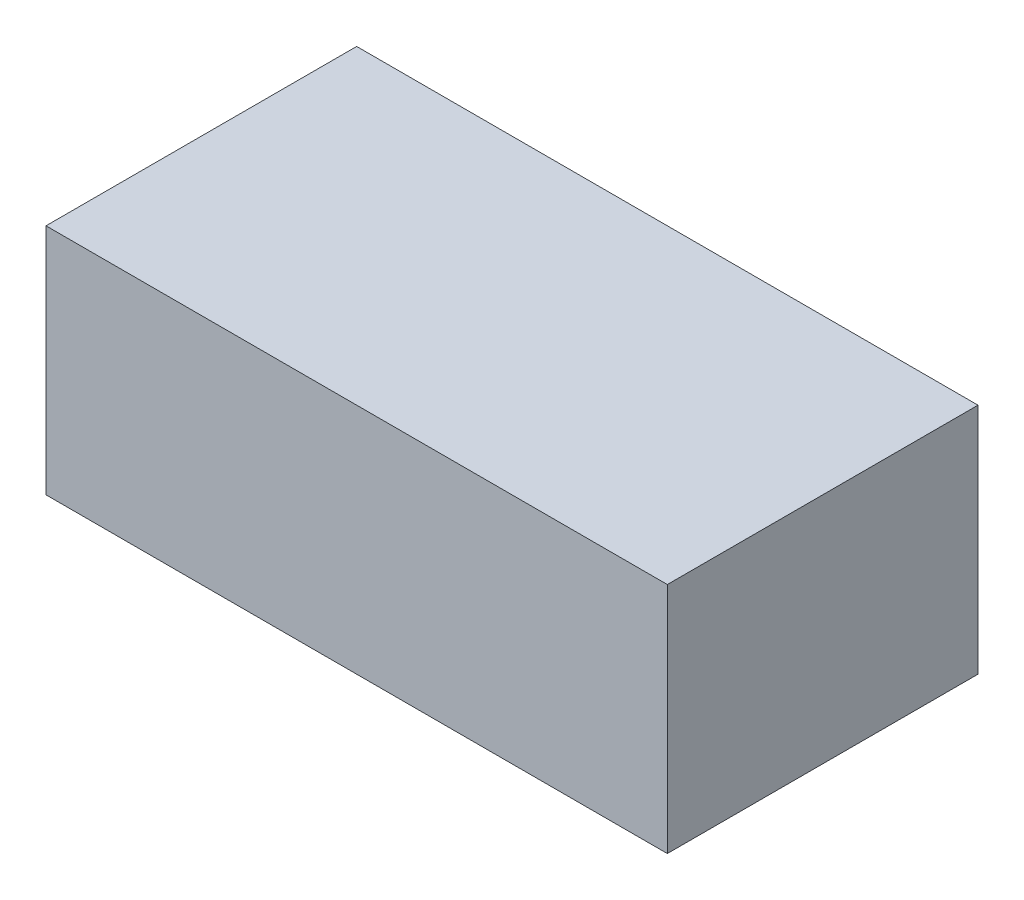
ISO-10303-21;
HEADER;
FILE_DESCRIPTION(('STEP AP214'),'2;1');
FILE_NAME('part.step','',(''),(''),'','','');
FILE_SCHEMA(('AUTOMOTIVE_DESIGN { 1 0 10303 214 1 1 1 1 }'));
ENDSEC;
DATA;
#1=APPLICATION_CONTEXT('core data for automotive mechanical design processes');
#2=APPLICATION_PROTOCOL_DEFINITION('international standard','automotive_design',2000,#1);
#3=PRODUCT_CONTEXT('',#1,'mechanical');
#4=PRODUCT('Part','Part','',(#3));
#5=PRODUCT_RELATED_PRODUCT_CATEGORY('part','',(#4));
#6=PRODUCT_DEFINITION_FORMATION('','',#4);
#7=PRODUCT_DEFINITION_CONTEXT('part definition',#1,'design');
#8=PRODUCT_DEFINITION('design','',#6,#7);
#9=PRODUCT_DEFINITION_SHAPE('','',#8);
#10=(LENGTH_UNIT() NAMED_UNIT(*) SI_UNIT(.MILLI.,.METRE.));
#11=(NAMED_UNIT(*) PLANE_ANGLE_UNIT() SI_UNIT($,.RADIAN.));
#12=(NAMED_UNIT(*) SI_UNIT($,.STERADIAN.) SOLID_ANGLE_UNIT());
#13=UNCERTAINTY_MEASURE_WITH_UNIT(LENGTH_MEASURE(1.E-05),#10,'distance_accuracy_value','');
#14=(GEOMETRIC_REPRESENTATION_CONTEXT(3) GLOBAL_UNCERTAINTY_ASSIGNED_CONTEXT((#13)) GLOBAL_UNIT_ASSIGNED_CONTEXT((#10,
#11,#12)) REPRESENTATION_CONTEXT('',''));
#15=CARTESIAN_POINT('',(0.,0.,0.));
#16=DIRECTION('',(0.,0.,1.));
#17=DIRECTION('',(1.,0.,0.));
#18=AXIS2_PLACEMENT_3D('',#15,#16,#17);
#19=CARTESIAN_POINT('',(80.,60.,-40.));
#20=DIRECTION('',(-1.,0.,0.));
#21=DIRECTION('',(0.,0.,1.));
#22=AXIS2_PLACEMENT_3D('',#19,#20,#21);
#23=PLANE('',#22);
#24=DIRECTION('',(0.,0.,-1.));
#25=VECTOR('',#24,1.);
#26=CARTESIAN_POINT('',(80.,0.,-40.));
#27=LINE('',#26,#25);
#28=CARTESIAN_POINT('',(80.,0.,40.));
#29=VERTEX_POINT('',#28);
#30=CARTESIAN_POINT('',(80.,0.,-40.));
#31=VERTEX_POINT('',#30);
#32=EDGE_CURVE('E98',#29,#31,#27,.T.);
#33=ORIENTED_EDGE('',*,*,#32,.T.);
#34=DIRECTION('',(0.,-1.,0.));
#35=VECTOR('',#34,1.);
#36=CARTESIAN_POINT('',(80.,60.,-40.));
#37=LINE('',#36,#35);
#38=CARTESIAN_POINT('',(80.,60.,-40.));
#39=VERTEX_POINT('',#38);
#40=EDGE_CURVE('E11',#39,#31,#37,.T.);
#41=ORIENTED_EDGE('',*,*,#40,.F.);
#42=DIRECTION('',(0.,0.,-1.));
#43=VECTOR('',#42,1.);
#44=CARTESIAN_POINT('',(80.,60.,-40.));
#45=LINE('',#44,#43);
#46=CARTESIAN_POINT('',(80.,60.,40.));
#47=VERTEX_POINT('',#46);
#48=EDGE_CURVE('E86',#47,#39,#45,.T.);
#49=ORIENTED_EDGE('',*,*,#48,.F.);
#50=DIRECTION('',(0.,-1.,0.));
#51=VECTOR('',#50,1.);
#52=CARTESIAN_POINT('',(80.,60.,40.));
#53=LINE('',#52,#51);
#54=EDGE_CURVE('E94',#47,#29,#53,.T.);
#55=ORIENTED_EDGE('',*,*,#54,.T.);
#56=EDGE_LOOP('',(#33,#41,#49,#55));
#57=FACE_BOUND('',#56,.T.);
#58=ADVANCED_FACE('F35',(#57),#23,.F.);
#59=CARTESIAN_POINT('',(-80.,60.,-40.));
#60=DIRECTION('',(0.,0.,1.));
#61=DIRECTION('',(1.,0.,0.));
#62=AXIS2_PLACEMENT_3D('',#59,#60,#61);
#63=PLANE('',#62);
#64=DIRECTION('',(-1.,0.,0.));
#65=VECTOR('',#64,1.);
#66=CARTESIAN_POINT('',(-80.,0.,-40.));
#67=LINE('',#66,#65);
#68=CARTESIAN_POINT('',(-80.,0.,-40.));
#69=VERTEX_POINT('',#68);
#70=EDGE_CURVE('E90',#31,#69,#67,.T.);
#71=ORIENTED_EDGE('',*,*,#70,.T.);
#72=DIRECTION('',(0.,-1.,0.));
#73=VECTOR('',#72,1.);
#74=CARTESIAN_POINT('',(-80.,60.,-40.));
#75=LINE('',#74,#73);
#76=CARTESIAN_POINT('',(-80.,60.,-40.));
#77=VERTEX_POINT('',#76);
#78=EDGE_CURVE('E43',#77,#69,#75,.T.);
#79=ORIENTED_EDGE('',*,*,#78,.F.);
#80=DIRECTION('',(-1.,0.,0.));
#81=VECTOR('',#80,1.);
#82=CARTESIAN_POINT('',(-80.,60.,-40.));
#83=LINE('',#82,#81);
#84=EDGE_CURVE('E81',#39,#77,#83,.T.);
#85=ORIENTED_EDGE('',*,*,#84,.F.);
#86=ORIENTED_EDGE('',*,*,#40,.T.);
#87=EDGE_LOOP('',(#71,#79,#85,#86));
#88=FACE_BOUND('',#87,.T.);
#89=ADVANCED_FACE('F89',(#88),#63,.F.);
#90=CARTESIAN_POINT('',(-80.,60.,-40.));
#91=DIRECTION('',(1.,0.,0.));
#92=DIRECTION('',(0.,0.,-1.));
#93=AXIS2_PLACEMENT_3D('',#90,#91,#92);
#94=PLANE('',#93);
#95=DIRECTION('',(0.,0.,1.));
#96=VECTOR('',#95,1.);
#97=CARTESIAN_POINT('',(-80.,0.,-40.));
#98=LINE('',#97,#96);
#99=CARTESIAN_POINT('',(-80.,0.,40.));
#100=VERTEX_POINT('',#99);
#101=EDGE_CURVE('E68',#69,#100,#98,.T.);
#102=ORIENTED_EDGE('',*,*,#101,.T.);
#103=DIRECTION('',(0.,-1.,0.));
#104=VECTOR('',#103,1.);
#105=CARTESIAN_POINT('',(-80.,60.,40.));
#106=LINE('',#105,#104);
#107=CARTESIAN_POINT('',(-80.,60.,40.));
#108=VERTEX_POINT('',#107);
#109=EDGE_CURVE('E91',#108,#100,#106,.T.);
#110=ORIENTED_EDGE('',*,*,#109,.F.);
#111=DIRECTION('',(0.,0.,1.));
#112=VECTOR('',#111,1.);
#113=CARTESIAN_POINT('',(-80.,60.,-40.));
#114=LINE('',#113,#112);
#115=EDGE_CURVE('E84',#77,#108,#114,.T.);
#116=ORIENTED_EDGE('',*,*,#115,.F.);
#117=ORIENTED_EDGE('',*,*,#78,.T.);
#118=EDGE_LOOP('',(#102,#110,#116,#117));
#119=FACE_BOUND('',#118,.T.);
#120=ADVANCED_FACE('F92',(#119),#94,.F.);
#121=CARTESIAN_POINT('',(-80.,60.,40.));
#122=DIRECTION('',(0.,0.,-1.));
#123=DIRECTION('',(-1.,0.,0.));
#124=AXIS2_PLACEMENT_3D('',#121,#122,#123);
#125=PLANE('',#124);
#126=DIRECTION('',(1.,0.,0.));
#127=VECTOR('',#126,1.);
#128=CARTESIAN_POINT('',(-80.,0.,40.));
#129=LINE('',#128,#127);
#130=EDGE_CURVE('E74',#100,#29,#129,.T.);
#131=ORIENTED_EDGE('',*,*,#130,.T.);
#132=ORIENTED_EDGE('',*,*,#54,.F.);
#133=DIRECTION('',(1.,0.,0.));
#134=VECTOR('',#133,1.);
#135=CARTESIAN_POINT('',(-80.,60.,40.));
#136=LINE('',#135,#134);
#137=EDGE_CURVE('E51',#108,#47,#136,.T.);
#138=ORIENTED_EDGE('',*,*,#137,.F.);
#139=ORIENTED_EDGE('',*,*,#109,.T.);
#140=EDGE_LOOP('',(#131,#132,#138,#139));
#141=FACE_BOUND('',#140,.T.);
#142=ADVANCED_FACE('F105',(#141),#125,.F.);
#143=CARTESIAN_POINT('',(0.,60.,0.));
#144=DIRECTION('',(0.,1.,0.));
#145=DIRECTION('',(0.,0.,1.));
#146=AXIS2_PLACEMENT_3D('',#143,#144,#145);
#147=PLANE('',#146);
#148=ORIENTED_EDGE('',*,*,#48,.T.);
#149=ORIENTED_EDGE('',*,*,#84,.T.);
#150=ORIENTED_EDGE('',*,*,#115,.T.);
#151=ORIENTED_EDGE('',*,*,#137,.T.);
#152=EDGE_LOOP('',(#148,#149,#150,#151));
#153=FACE_BOUND('',#152,.T.);
#154=ADVANCED_FACE('F82',(#153),#147,.T.);
#155=CARTESIAN_POINT('',(0.,0.,0.));
#156=DIRECTION('',(0.,1.,0.));
#157=DIRECTION('',(0.,0.,1.));
#158=AXIS2_PLACEMENT_3D('',#155,#156,#157);
#159=PLANE('',#158);
#160=ORIENTED_EDGE('',*,*,#32,.F.);
#161=ORIENTED_EDGE('',*,*,#130,.F.);
#162=ORIENTED_EDGE('',*,*,#101,.F.);
#163=ORIENTED_EDGE('',*,*,#70,.F.);
#164=EDGE_LOOP('',(#160,#161,#162,#163));
#165=FACE_BOUND('',#164,.T.);
#166=ADVANCED_FACE('F108',(#165),#159,.F.);
#167=CLOSED_SHELL('',(#58,#89,#120,#142,#154,#166));
#168=MANIFOLD_SOLID_BREP('B2',#167);
#169=ADVANCED_BREP_SHAPE_REPRESENTATION('',(#18,#168),#14);
#170=SHAPE_DEFINITION_REPRESENTATION(#9,#169);
ENDSEC;
END-ISO-10303-21;
